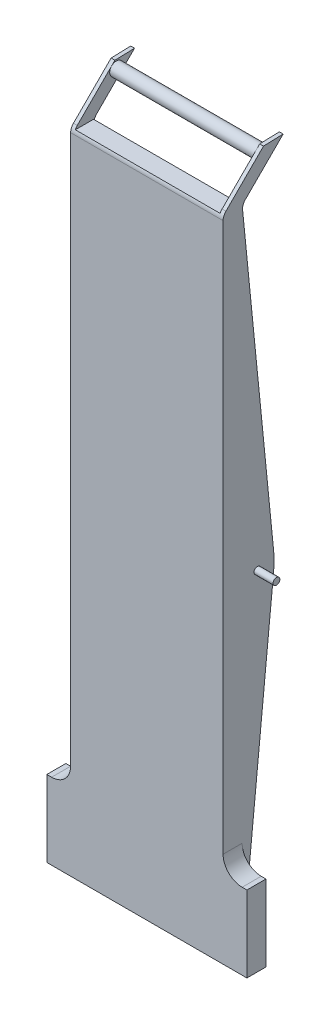
ISO-10303-21;
HEADER;
FILE_DESCRIPTION(('STEP AP214'),'2;1');
FILE_NAME('part.step','',(''),(''),'','','');
FILE_SCHEMA(('AUTOMOTIVE_DESIGN { 1 0 10303 214 1 1 1 1 }'));
ENDSEC;
DATA;
#1=APPLICATION_CONTEXT('core data for automotive mechanical design processes');
#2=APPLICATION_PROTOCOL_DEFINITION('international standard','automotive_design',2000,#1);
#3=PRODUCT_CONTEXT('',#1,'mechanical');
#4=PRODUCT('Part','Part','',(#3));
#5=PRODUCT_RELATED_PRODUCT_CATEGORY('part','',(#4));
#6=PRODUCT_DEFINITION_FORMATION('','',#4);
#7=PRODUCT_DEFINITION_CONTEXT('part definition',#1,'design');
#8=PRODUCT_DEFINITION('design','',#6,#7);
#9=PRODUCT_DEFINITION_SHAPE('','',#8);
#10=(LENGTH_UNIT() NAMED_UNIT(*) SI_UNIT(.MILLI.,.METRE.));
#11=(NAMED_UNIT(*) PLANE_ANGLE_UNIT() SI_UNIT($,.RADIAN.));
#12=(NAMED_UNIT(*) SI_UNIT($,.STERADIAN.) SOLID_ANGLE_UNIT());
#13=UNCERTAINTY_MEASURE_WITH_UNIT(LENGTH_MEASURE(1.E-05),#10,'distance_accuracy_value','');
#14=(GEOMETRIC_REPRESENTATION_CONTEXT(3) GLOBAL_UNCERTAINTY_ASSIGNED_CONTEXT((#13)) GLOBAL_UNIT_ASSIGNED_CONTEXT((#10,
#11,#12)) REPRESENTATION_CONTEXT('',''));
#15=CARTESIAN_POINT('',(0.,0.,0.));
#16=DIRECTION('',(0.,0.,1.));
#17=DIRECTION('',(1.,0.,0.));
#18=AXIS2_PLACEMENT_3D('',#15,#16,#17);
#19=CARTESIAN_POINT('',(-38.,148.139881816995,-5.2109496288609));
#20=DIRECTION('',(1.,0.,0.));
#21=DIRECTION('',(0.,1.,0.));
#22=AXIS2_PLACEMENT_3D('',#19,#20,#21);
#23=CYLINDRICAL_SURFACE('',#22,5.);
#24=DIRECTION('',(-1.,0.,0.));
#25=VECTOR('',#24,1.);
#26=CARTESIAN_POINT('',(-38.,151.675415722928,-1.67541572292816));
#27=LINE('',#26,#25);
#28=CARTESIAN_POINT('',(-38.,151.675415722928,-1.67541572292816));
#29=VERTEX_POINT('',#28);
#30=CARTESIAN_POINT('',(-40.,151.675415722928,-1.67541572292816));
#31=VERTEX_POINT('',#30);
#32=EDGE_CURVE('E390',#29,#31,#27,.T.);
#33=ORIENTED_EDGE('',*,*,#32,.F.);
#34=CARTESIAN_POINT('',(-38.,148.139881816995,-5.2109496288609));
#35=DIRECTION('',(1.,0.,0.));
#36=DIRECTION('',(0.,0.,-1.));
#37=AXIS2_PLACEMENT_3D('',#34,#35,#36);
#38=CIRCLE('',#37,5.);
#39=CARTESIAN_POINT('',(-38.,147.64236322189,-0.23576367781095));
#40=VERTEX_POINT('',#39);
#41=EDGE_CURVE('E49',#29,#40,#38,.T.);
#42=ORIENTED_EDGE('',*,*,#41,.T.);
#43=DIRECTION('',(-1.,0.,0.));
#44=VECTOR('',#43,1.);
#45=CARTESIAN_POINT('',(-38.,147.64236322189,-0.235763677810956));
#46=LINE('',#45,#44);
#47=CARTESIAN_POINT('',(-40.,147.64236322189,-0.235763677810958));
#48=VERTEX_POINT('',#47);
#49=EDGE_CURVE('E395',#48,#40,#46,.F.);
#50=ORIENTED_EDGE('',*,*,#49,.F.);
#51=CARTESIAN_POINT('',(-40.,148.139881816995,-5.2109496288609));
#52=DIRECTION('',(-1.,0.,0.));
#53=DIRECTION('',(0.,-1.,0.));
#54=AXIS2_PLACEMENT_3D('',#51,#52,#53);
#55=CIRCLE('',#54,5.);
#56=EDGE_CURVE('E12',#48,#31,#55,.T.);
#57=ORIENTED_EDGE('',*,*,#56,.T.);
#58=EDGE_LOOP('',(#33,#42,#50,#57));
#59=FACE_BOUND('',#58,.T.);
#60=ADVANCED_FACE('F42',(#59),#23,.F.);
#61=CARTESIAN_POINT('',(38.,148.139881816995,-5.2109496288609));
#62=DIRECTION('',(1.,0.,0.));
#63=DIRECTION('',(0.,1.,0.));
#64=AXIS2_PLACEMENT_3D('',#61,#62,#63);
#65=CYLINDRICAL_SURFACE('',#64,5.);
#66=DIRECTION('',(-1.,0.,0.));
#67=VECTOR('',#66,1.);
#68=CARTESIAN_POINT('',(38.,151.675415722928,-1.67541572292817));
#69=LINE('',#68,#67);
#70=CARTESIAN_POINT('',(40.,151.675415722928,-1.67541572292816));
#71=VERTEX_POINT('',#70);
#72=CARTESIAN_POINT('',(38.,151.675415722928,-1.67541572292816));
#73=VERTEX_POINT('',#72);
#74=EDGE_CURVE('E377',#71,#73,#69,.T.);
#75=ORIENTED_EDGE('',*,*,#74,.F.);
#76=CARTESIAN_POINT('',(40.,148.139881816995,-5.2109496288609));
#77=DIRECTION('',(1.,0.,0.));
#78=DIRECTION('',(0.,0.,-1.));
#79=AXIS2_PLACEMENT_3D('',#76,#77,#78);
#80=CIRCLE('',#79,5.);
#81=CARTESIAN_POINT('',(40.,147.64236322189,-0.235763677810958));
#82=VERTEX_POINT('',#81);
#83=EDGE_CURVE('E386',#71,#82,#80,.T.);
#84=ORIENTED_EDGE('',*,*,#83,.T.);
#85=DIRECTION('',(-1.,0.,0.));
#86=VECTOR('',#85,1.);
#87=CARTESIAN_POINT('',(38.,147.64236322189,-0.235763677810957));
#88=LINE('',#87,#86);
#89=CARTESIAN_POINT('',(38.,147.64236322189,-0.235763677810956));
#90=VERTEX_POINT('',#89);
#91=EDGE_CURVE('E383',#90,#82,#88,.F.);
#92=ORIENTED_EDGE('',*,*,#91,.F.);
#93=CARTESIAN_POINT('',(38.,148.139881816995,-5.2109496288609));
#94=DIRECTION('',(1.,0.,0.));
#95=DIRECTION('',(0.,0.,-1.));
#96=AXIS2_PLACEMENT_3D('',#93,#94,#95);
#97=CIRCLE('',#96,5.);
#98=EDGE_CURVE('E388',#90,#73,#97,.F.);
#99=ORIENTED_EDGE('',*,*,#98,.T.);
#100=EDGE_LOOP('',(#75,#84,#92,#99));
#101=FACE_BOUND('',#100,.T.);
#102=ADVANCED_FACE('F413',(#101),#65,.F.);
#103=CARTESIAN_POINT('',(-38.,147.928932188135,5.));
#104=DIRECTION('',(-1.,0.,0.));
#105=DIRECTION('',(0.,-1.,0.));
#106=AXIS2_PLACEMENT_3D('',#103,#104,#105);
#107=CYLINDRICAL_SURFACE('',#106,5.);
#108=DIRECTION('',(1.,0.,0.));
#109=VECTOR('',#108,1.);
#110=CARTESIAN_POINT('',(-38.,151.464466094067,8.53553390593275));
#111=LINE('',#110,#109);
#112=CARTESIAN_POINT('',(-40.,151.464466094067,8.53553390593274));
#113=VERTEX_POINT('',#112);
#114=CARTESIAN_POINT('',(-38.,151.464466094067,8.53553390593275));
#115=VERTEX_POINT('',#114);
#116=EDGE_CURVE('E207',#113,#115,#111,.T.);
#117=ORIENTED_EDGE('',*,*,#116,.F.);
#118=CARTESIAN_POINT('',(-40.,147.928932188135,5.));
#119=DIRECTION('',(-1.,0.,0.));
#120=DIRECTION('',(0.,-1.,0.));
#121=AXIS2_PLACEMENT_3D('',#118,#119,#120);
#122=CIRCLE('',#121,5.);
#123=CARTESIAN_POINT('',(-40.,147.928932188135,10.));
#124=VERTEX_POINT('',#123);
#125=EDGE_CURVE('E375',#124,#113,#122,.T.);
#126=ORIENTED_EDGE('',*,*,#125,.F.);
#127=DIRECTION('',(1.,0.,0.));
#128=VECTOR('',#127,1.);
#129=CARTESIAN_POINT('',(-38.,147.928932188135,10.));
#130=LINE('',#129,#128);
#131=CARTESIAN_POINT('',(40.,147.928932188135,10.));
#132=VERTEX_POINT('',#131);
#133=EDGE_CURVE('E372',#132,#124,#130,.F.);
#134=ORIENTED_EDGE('',*,*,#133,.F.);
#135=CARTESIAN_POINT('',(40.,147.928932188135,5.));
#136=DIRECTION('',(1.,0.,0.));
#137=DIRECTION('',(0.,0.,-1.));
#138=AXIS2_PLACEMENT_3D('',#135,#136,#137);
#139=CIRCLE('',#138,5.);
#140=CARTESIAN_POINT('',(40.,151.464466094067,8.53553390593275));
#141=VERTEX_POINT('',#140);
#142=EDGE_CURVE('E369',#141,#132,#139,.T.);
#143=ORIENTED_EDGE('',*,*,#142,.F.);
#144=DIRECTION('',(-1.,0.,0.));
#145=VECTOR('',#144,1.);
#146=CARTESIAN_POINT('',(-38.,151.464466094067,8.53553390593274));
#147=LINE('',#146,#145);
#148=CARTESIAN_POINT('',(38.,151.464466094067,8.53553390593275));
#149=VERTEX_POINT('',#148);
#150=EDGE_CURVE('E366',#149,#141,#147,.F.);
#151=ORIENTED_EDGE('',*,*,#150,.F.);
#152=CARTESIAN_POINT('',(38.,147.928932188135,5.));
#153=DIRECTION('',(1.,0.,0.));
#154=DIRECTION('',(0.,0.,-1.));
#155=AXIS2_PLACEMENT_3D('',#152,#153,#154);
#156=CIRCLE('',#155,5.);
#157=CARTESIAN_POINT('',(38.,150.,9.55089860562228));
#158=VERTEX_POINT('',#157);
#159=EDGE_CURVE('E363',#158,#149,#156,.F.);
#160=ORIENTED_EDGE('',*,*,#159,.F.);
#161=DIRECTION('',(-1.,0.,0.));
#162=VECTOR('',#161,1.);
#163=CARTESIAN_POINT('',(-38.,150.,9.55089860562228));
#164=LINE('',#163,#162);
#165=CARTESIAN_POINT('',(-38.,150.,9.55089860562228));
#166=VERTEX_POINT('',#165);
#167=EDGE_CURVE('E360',#166,#158,#164,.F.);
#168=ORIENTED_EDGE('',*,*,#167,.F.);
#169=CARTESIAN_POINT('',(-38.,147.928932188135,5.));
#170=DIRECTION('',(1.,0.,0.));
#171=DIRECTION('',(0.,0.,-1.));
#172=AXIS2_PLACEMENT_3D('',#169,#170,#171);
#173=CIRCLE('',#172,5.);
#174=EDGE_CURVE('E358',#115,#166,#173,.T.);
#175=ORIENTED_EDGE('',*,*,#174,.F.);
#176=EDGE_LOOP('',(#117,#126,#134,#143,#151,#160,#168,#175));
#177=FACE_BOUND('',#176,.T.);
#178=ADVANCED_FACE('F472',(#177),#107,.T.);
#179=CARTESIAN_POINT('',(38.,150.,0.));
#180=DIRECTION('',(0.,-0.707106781186546,-0.707106781186549));
#181=DIRECTION('',(0.,0.707106781186549,-0.707106781186546));
#182=AXIS2_PLACEMENT_3D('',#179,#180,#181);
#183=PLANE('',#182);
#184=DIRECTION('',(0.,0.707106781186549,-0.707106781186546));
#185=VECTOR('',#184,1.);
#186=CARTESIAN_POINT('',(40.,150.,0.));
#187=LINE('',#186,#185);
#188=CARTESIAN_POINT('',(40.,171.533549547824,-21.5335495478236));
#189=VERTEX_POINT('',#188);
#190=EDGE_CURVE('E330',#71,#189,#187,.T.);
#191=ORIENTED_EDGE('',*,*,#190,.F.);
#192=ORIENTED_EDGE('',*,*,#74,.T.);
#193=DIRECTION('',(0.,0.707106781186549,-0.707106781186546));
#194=VECTOR('',#193,1.);
#195=CARTESIAN_POINT('',(38.,150.,0.));
#196=LINE('',#195,#194);
#197=CARTESIAN_POINT('',(38.,171.533549547824,-21.5335495478236));
#198=VERTEX_POINT('',#197);
#199=EDGE_CURVE('E331',#73,#198,#196,.T.);
#200=ORIENTED_EDGE('',*,*,#199,.T.);
#201=DIRECTION('',(1.,0.,0.));
#202=VECTOR('',#201,1.);
#203=CARTESIAN_POINT('',(38.,171.533549547824,-21.5335495478236));
#204=LINE('',#203,#202);
#205=EDGE_CURVE('E343',#198,#189,#204,.T.);
#206=ORIENTED_EDGE('',*,*,#205,.T.);
#207=EDGE_LOOP('',(#191,#192,#200,#206));
#208=FACE_BOUND('',#207,.T.);
#209=ADVANCED_FACE('F482',(#208),#183,.T.);
#210=CARTESIAN_POINT('',(38.,150.,10.));
#211=DIRECTION('',(0.,0.707106781186546,0.707106781186549));
#212=DIRECTION('',(0.,-0.707106781186549,0.707106781186546));
#213=AXIS2_PLACEMENT_3D('',#210,#211,#212);
#214=PLANE('',#213);
#215=DIRECTION('',(0.,-0.707106781186549,0.707106781186546));
#216=VECTOR('',#215,1.);
#217=CARTESIAN_POINT('',(38.,150.,10.));
#218=LINE('',#217,#216);
#219=CARTESIAN_POINT('',(38.,171.213203435596,-11.2132034355964));
#220=VERTEX_POINT('',#219);
#221=EDGE_CURVE('E337',#220,#149,#218,.T.);
#222=ORIENTED_EDGE('',*,*,#221,.T.);
#223=ORIENTED_EDGE('',*,*,#150,.T.);
#224=DIRECTION('',(0.,-0.707106781186549,0.707106781186546));
#225=VECTOR('',#224,1.);
#226=CARTESIAN_POINT('',(40.,150.,10.));
#227=LINE('',#226,#225);
#228=CARTESIAN_POINT('',(40.,171.213203435596,-11.2132034355964));
#229=VERTEX_POINT('',#228);
#230=EDGE_CURVE('E334',#229,#141,#227,.T.);
#231=ORIENTED_EDGE('',*,*,#230,.F.);
#232=DIRECTION('',(1.,0.,0.));
#233=VECTOR('',#232,1.);
#234=CARTESIAN_POINT('',(38.,171.213203435596,-11.2132034355964));
#235=LINE('',#234,#233);
#236=EDGE_CURVE('E350',#220,#229,#235,.T.);
#237=ORIENTED_EDGE('',*,*,#236,.F.);
#238=EDGE_LOOP('',(#222,#223,#231,#237));
#239=FACE_BOUND('',#238,.T.);
#240=ADVANCED_FACE('F476',(#239),#214,.T.);
#241=CARTESIAN_POINT('',(38.,171.533549547824,-21.5335495478236));
#242=DIRECTION('',(0.,0.99951859931679,0.0310253061193878));
#243=DIRECTION('',(0.,-0.0310253061193878,0.99951859931679));
#244=AXIS2_PLACEMENT_3D('',#241,#242,#243);
#245=PLANE('',#244);
#246=DIRECTION('',(0.,-0.0310253061193878,0.99951859931679));
#247=VECTOR('',#246,1.);
#248=CARTESIAN_POINT('',(40.,171.533549547824,-21.5335495478236));
#249=LINE('',#248,#247);
#250=EDGE_CURVE('E345',#189,#229,#249,.T.);
#251=ORIENTED_EDGE('',*,*,#250,.F.);
#252=ORIENTED_EDGE('',*,*,#205,.F.);
#253=DIRECTION('',(0.,-0.0310253061193878,0.99951859931679));
#254=VECTOR('',#253,1.);
#255=CARTESIAN_POINT('',(38.,171.533549547824,-21.5335495478236));
#256=LINE('',#255,#254);
#257=EDGE_CURVE('E333',#198,#220,#256,.T.);
#258=ORIENTED_EDGE('',*,*,#257,.T.);
#259=ORIENTED_EDGE('',*,*,#236,.T.);
#260=EDGE_LOOP('',(#251,#252,#258,#259));
#261=FACE_BOUND('',#260,.T.);
#262=ADVANCED_FACE('F480',(#261),#245,.T.);
#263=CARTESIAN_POINT('',(38.,0.,0.));
#264=DIRECTION('',(1.,0.,0.));
#265=DIRECTION('',(0.,0.,-1.));
#266=AXIS2_PLACEMENT_3D('',#263,#264,#265);
#267=PLANE('',#266);
#268=CARTESIAN_POINT('',(38.,167.,-11.9992449429889));
#269=DIRECTION('',(1.,0.,0.));
#270=DIRECTION('',(0.,0.,-1.));
#271=AXIS2_PLACEMENT_3D('',#268,#269,#270);
#272=CIRCLE('',#271,3.5);
#273=CARTESIAN_POINT('',(38.,167.,-15.4992449429889));
#274=VERTEX_POINT('',#273);
#275=EDGE_CURVE('E327',#274,#274,#272,.T.);
#276=ORIENTED_EDGE('',*,*,#275,.T.);
#277=EDGE_LOOP('',(#276));
#278=FACE_BOUND('',#277,.T.);
#279=DIRECTION('',(0.,0.,-1.));
#280=VECTOR('',#279,1.);
#281=CARTESIAN_POINT('',(38.,150.,0.));
#282=LINE('',#281,#280);
#283=CARTESIAN_POINT('',(38.,150.,0.));
#284=VERTEX_POINT('',#283);
#285=EDGE_CURVE('E340',#158,#284,#282,.T.);
#286=ORIENTED_EDGE('',*,*,#285,.F.);
#287=ORIENTED_EDGE('',*,*,#159,.T.);
#288=ORIENTED_EDGE('',*,*,#221,.F.);
#289=ORIENTED_EDGE('',*,*,#257,.F.);
#290=ORIENTED_EDGE('',*,*,#199,.F.);
#291=ORIENTED_EDGE('',*,*,#98,.F.);
#292=DIRECTION('',(0.,-0.995037190209989,-0.0995037190209991));
#293=VECTOR('',#292,1.);
#294=CARTESIAN_POINT('',(38.,150.,0.));
#295=LINE('',#294,#293);
#296=EDGE_CURVE('E380',#284,#90,#295,.T.);
#297=ORIENTED_EDGE('',*,*,#296,.F.);
#298=EDGE_LOOP('',(#286,#287,#288,#289,#290,#291,#297));
#299=FACE_BOUND('',#298,.T.);
#300=ADVANCED_FACE('F408',(#278,#299),#267,.F.);
#301=CARTESIAN_POINT('',(40.,0.,0.));
#302=DIRECTION('',(1.,0.,0.));
#303=DIRECTION('',(0.,0.,-1.));
#304=AXIS2_PLACEMENT_3D('',#301,#302,#303);
#305=PLANE('',#304);
#306=ORIENTED_EDGE('',*,*,#83,.F.);
#307=ORIENTED_EDGE('',*,*,#190,.T.);
#308=ORIENTED_EDGE('',*,*,#250,.T.);
#309=ORIENTED_EDGE('',*,*,#230,.T.);
#310=ORIENTED_EDGE('',*,*,#142,.T.);
#311=DIRECTION('',(0.,1.,0.));
#312=VECTOR('',#311,1.);
#313=CARTESIAN_POINT('',(40.,150.,10.));
#314=LINE('',#313,#312);
#315=CARTESIAN_POINT('',(40.,-140.,10.));
#316=VERTEX_POINT('',#315);
#317=EDGE_CURVE('E274',#316,#132,#314,.T.);
#318=ORIENTED_EDGE('',*,*,#317,.F.);
#319=DIRECTION('',(0.,0.,-1.));
#320=VECTOR('',#319,1.);
#321=CARTESIAN_POINT('',(40.,-140.,10.));
#322=LINE('',#321,#320);
#323=CARTESIAN_POINT('',(40.,-140.,0.));
#324=VERTEX_POINT('',#323);
#325=EDGE_CURVE('E277',#316,#324,#322,.T.);
#326=ORIENTED_EDGE('',*,*,#325,.T.);
#327=DIRECTION('',(0.,-1.,0.));
#328=VECTOR('',#327,1.);
#329=CARTESIAN_POINT('',(40.,150.,0.));
#330=LINE('',#329,#328);
#331=CARTESIAN_POINT('',(40.,-190.,0.));
#332=VERTEX_POINT('',#331);
#333=EDGE_CURVE('E244',#324,#332,#330,.T.);
#334=ORIENTED_EDGE('',*,*,#333,.T.);
#335=DIRECTION('',(0.,0.995037190209989,-0.099503719020999));
#336=VECTOR('',#335,1.);
#337=CARTESIAN_POINT('',(40.,-190.,0.));
#338=LINE('',#337,#336);
#339=CARTESIAN_POINT('',(40.,-24.9751859510499,-16.502481404895));
#340=VERTEX_POINT('',#339);
#341=EDGE_CURVE('E235',#332,#340,#338,.T.);
#342=ORIENTED_EDGE('',*,*,#341,.T.);
#343=CARTESIAN_POINT('',(40.,-20.,33.2493781056044));
#344=DIRECTION('',(-1.,0.,0.));
#345=DIRECTION('',(0.,-1.,0.));
#346=AXIS2_PLACEMENT_3D('',#343,#344,#345);
#347=CIRCLE('',#346,50.);
#348=CARTESIAN_POINT('',(40.,-15.02481404895,-16.502481404895));
#349=VERTEX_POINT('',#348);
#350=EDGE_CURVE('E320',#340,#349,#347,.F.);
#351=ORIENTED_EDGE('',*,*,#350,.T.);
#352=DIRECTION('',(0.,0.995037190209989,0.0995037190209991));
#353=VECTOR('',#352,1.);
#354=CARTESIAN_POINT('',(40.,150.,0.));
#355=LINE('',#354,#353);
#356=EDGE_CURVE('E251',#349,#82,#355,.T.);
#357=ORIENTED_EDGE('',*,*,#356,.T.);
#358=EDGE_LOOP('',(#306,#307,#308,#309,#310,#318,#326,#334,#342,#351,#357));
#359=FACE_BOUND('',#358,.T.);
#360=ADVANCED_FACE('F416',(#359),#305,.T.);
#361=CARTESIAN_POINT('',(40.,167.,-11.9992449429889));
#362=DIRECTION('',(-1.,0.,0.));
#363=DIRECTION('',(0.,-1.,0.));
#364=AXIS2_PLACEMENT_3D('',#361,#362,#363);
#365=CYLINDRICAL_SURFACE('',#364,3.5);
#366=CARTESIAN_POINT('',(-38.,167.,-11.9992449429889));
#367=DIRECTION('',(1.,0.,0.));
#368=DIRECTION('',(0.,0.,-1.));
#369=AXIS2_PLACEMENT_3D('',#366,#367,#368);
#370=CIRCLE('',#369,3.5);
#371=CARTESIAN_POINT('',(-38.,167.,-15.4992449429889));
#372=VERTEX_POINT('',#371);
#373=EDGE_CURVE('E352',#372,#372,#370,.F.);
#374=ORIENTED_EDGE('',*,*,#373,.F.);
#375=EDGE_LOOP('',(#374));
#376=FACE_BOUND('',#375,.T.);
#377=ORIENTED_EDGE('',*,*,#275,.F.);
#378=EDGE_LOOP('',(#377));
#379=FACE_BOUND('',#378,.T.);
#380=ADVANCED_FACE('F519',(#376,#379),#365,.T.);
#381=CARTESIAN_POINT('',(-40.,150.,10.));
#382=DIRECTION('',(0.,-1.,0.));
#383=DIRECTION('',(0.,0.,-1.));
#384=AXIS2_PLACEMENT_3D('',#381,#382,#383);
#385=PLANE('',#384);
#386=DIRECTION('',(0.,0.,1.));
#387=VECTOR('',#386,1.);
#388=CARTESIAN_POINT('',(-38.,150.,10.));
#389=LINE('',#388,#387);
#390=CARTESIAN_POINT('',(-38.,150.,0.));
#391=VERTEX_POINT('',#390);
#392=EDGE_CURVE('E220',#391,#166,#389,.T.);
#393=ORIENTED_EDGE('',*,*,#392,.T.);
#394=ORIENTED_EDGE('',*,*,#167,.T.);
#395=ORIENTED_EDGE('',*,*,#285,.T.);
#396=DIRECTION('',(-1.,0.,0.));
#397=VECTOR('',#396,1.);
#398=CARTESIAN_POINT('',(-40.,150.,0.));
#399=LINE('',#398,#397);
#400=EDGE_CURVE('E260',#284,#391,#399,.T.);
#401=ORIENTED_EDGE('',*,*,#400,.T.);
#402=EDGE_LOOP('',(#393,#394,#395,#401));
#403=FACE_BOUND('',#402,.T.);
#404=ADVANCED_FACE('F403',(#403),#385,.F.);
#405=CARTESIAN_POINT('',(-50.,-140.,0.));
#406=DIRECTION('',(0.,0.,-1.));
#407=DIRECTION('',(-1.,0.,0.));
#408=AXIS2_PLACEMENT_3D('',#405,#406,#407);
#409=PLANE('',#408);
#410=DIRECTION('',(0.,1.,0.));
#411=VECTOR('',#410,1.);
#412=CARTESIAN_POINT('',(-40.,150.,0.));
#413=LINE('',#412,#411);
#414=CARTESIAN_POINT('',(-40.,-190.,0.));
#415=VERTEX_POINT('',#414);
#416=CARTESIAN_POINT('',(-40.,-140.,0.));
#417=VERTEX_POINT('',#416);
#418=EDGE_CURVE('E239',#415,#417,#413,.T.);
#419=ORIENTED_EDGE('',*,*,#418,.F.);
#420=DIRECTION('',(1.,0.,0.));
#421=VECTOR('',#420,1.);
#422=CARTESIAN_POINT('',(-52.5,-190.,0.));
#423=LINE('',#422,#421);
#424=CARTESIAN_POINT('',(-52.5,-190.,0.));
#425=VERTEX_POINT('',#424);
#426=EDGE_CURVE('E284',#425,#415,#423,.T.);
#427=ORIENTED_EDGE('',*,*,#426,.F.);
#428=DIRECTION('',(0.,-1.,0.));
#429=VECTOR('',#428,1.);
#430=CARTESIAN_POINT('',(-52.5,-150.,0.));
#431=LINE('',#430,#429);
#432=CARTESIAN_POINT('',(-52.5,-150.,0.));
#433=VERTEX_POINT('',#432);
#434=EDGE_CURVE('E281',#433,#425,#431,.T.);
#435=ORIENTED_EDGE('',*,*,#434,.F.);
#436=DIRECTION('',(-1.,0.,0.));
#437=VECTOR('',#436,1.);
#438=CARTESIAN_POINT('',(-52.5,-150.,0.));
#439=LINE('',#438,#437);
#440=CARTESIAN_POINT('',(-50.,-150.,0.));
#441=VERTEX_POINT('',#440);
#442=EDGE_CURVE('E279',#441,#433,#439,.T.);
#443=ORIENTED_EDGE('',*,*,#442,.F.);
#444=CARTESIAN_POINT('',(-50.,-140.,0.));
#445=DIRECTION('',(0.,0.,-1.));
#446=DIRECTION('',(-1.,0.,0.));
#447=AXIS2_PLACEMENT_3D('',#444,#445,#446);
#448=CIRCLE('',#447,10.);
#449=EDGE_CURVE('E256',#417,#441,#448,.T.);
#450=ORIENTED_EDGE('',*,*,#449,.F.);
#451=EDGE_LOOP('',(#419,#427,#435,#443,#450));
#452=FACE_BOUND('',#451,.T.);
#453=ADVANCED_FACE('F464',(#452),#409,.T.);
#454=CARTESIAN_POINT('',(-50.,-140.,10.));
#455=DIRECTION('',(0.,0.,-1.));
#456=DIRECTION('',(-1.,0.,0.));
#457=AXIS2_PLACEMENT_3D('',#454,#455,#456);
#458=CYLINDRICAL_SURFACE('',#457,10.);
#459=ORIENTED_EDGE('',*,*,#449,.T.);
#460=DIRECTION('',(0.,0.,-1.));
#461=VECTOR('',#460,1.);
#462=CARTESIAN_POINT('',(-50.,-150.,10.));
#463=LINE('',#462,#461);
#464=CARTESIAN_POINT('',(-50.,-150.,10.));
#465=VERTEX_POINT('',#464);
#466=EDGE_CURVE('E313',#465,#441,#463,.T.);
#467=ORIENTED_EDGE('',*,*,#466,.F.);
#468=CARTESIAN_POINT('',(-50.,-140.,10.));
#469=DIRECTION('',(0.,0.,-1.));
#470=DIRECTION('',(-1.,0.,0.));
#471=AXIS2_PLACEMENT_3D('',#468,#469,#470);
#472=CIRCLE('',#471,10.);
#473=CARTESIAN_POINT('',(-40.,-140.,10.));
#474=VERTEX_POINT('',#473);
#475=EDGE_CURVE('E259',#474,#465,#472,.T.);
#476=ORIENTED_EDGE('',*,*,#475,.F.);
#477=DIRECTION('',(0.,0.,-1.));
#478=VECTOR('',#477,1.);
#479=CARTESIAN_POINT('',(-40.,-140.,10.));
#480=LINE('',#479,#478);
#481=EDGE_CURVE('E248',#474,#417,#480,.T.);
#482=ORIENTED_EDGE('',*,*,#481,.T.);
#483=EDGE_LOOP('',(#459,#467,#476,#482));
#484=FACE_BOUND('',#483,.T.);
#485=ADVANCED_FACE('F469',(#484),#458,.F.);
#486=CARTESIAN_POINT('',(-52.5,-150.,10.));
#487=DIRECTION('',(0.,-1.,0.));
#488=DIRECTION('',(0.,0.,-1.));
#489=AXIS2_PLACEMENT_3D('',#486,#487,#488);
#490=PLANE('',#489);
#491=ORIENTED_EDGE('',*,*,#442,.T.);
#492=DIRECTION('',(0.,0.,-1.));
#493=VECTOR('',#492,1.);
#494=CARTESIAN_POINT('',(-52.5,-150.,10.));
#495=LINE('',#494,#493);
#496=CARTESIAN_POINT('',(-52.5,-150.,10.));
#497=VERTEX_POINT('',#496);
#498=EDGE_CURVE('E310',#497,#433,#495,.T.);
#499=ORIENTED_EDGE('',*,*,#498,.F.);
#500=DIRECTION('',(-1.,0.,0.));
#501=VECTOR('',#500,1.);
#502=CARTESIAN_POINT('',(-52.5,-150.,10.));
#503=LINE('',#502,#501);
#504=EDGE_CURVE('E262',#465,#497,#503,.T.);
#505=ORIENTED_EDGE('',*,*,#504,.F.);
#506=ORIENTED_EDGE('',*,*,#466,.T.);
#507=EDGE_LOOP('',(#491,#499,#505,#506));
#508=FACE_BOUND('',#507,.T.);
#509=ADVANCED_FACE('F530',(#508),#490,.F.);
#510=CARTESIAN_POINT('',(-52.5,-150.,10.));
#511=DIRECTION('',(1.,0.,0.));
#512=DIRECTION('',(0.,1.,0.));
#513=AXIS2_PLACEMENT_3D('',#510,#511,#512);
#514=PLANE('',#513);
#515=ORIENTED_EDGE('',*,*,#434,.T.);
#516=DIRECTION('',(0.,0.,-1.));
#517=VECTOR('',#516,1.);
#518=CARTESIAN_POINT('',(-52.5,-190.,10.));
#519=LINE('',#518,#517);
#520=CARTESIAN_POINT('',(-52.5,-190.,10.));
#521=VERTEX_POINT('',#520);
#522=EDGE_CURVE('E307',#521,#425,#519,.T.);
#523=ORIENTED_EDGE('',*,*,#522,.F.);
#524=DIRECTION('',(0.,-1.,0.));
#525=VECTOR('',#524,1.);
#526=CARTESIAN_POINT('',(-52.5,-150.,10.));
#527=LINE('',#526,#525);
#528=EDGE_CURVE('E264',#497,#521,#527,.T.);
#529=ORIENTED_EDGE('',*,*,#528,.F.);
#530=ORIENTED_EDGE('',*,*,#498,.T.);
#531=EDGE_LOOP('',(#515,#523,#529,#530));
#532=FACE_BOUND('',#531,.T.);
#533=ADVANCED_FACE('F460',(#532),#514,.F.);
#534=CARTESIAN_POINT('',(-52.5,-190.,10.));
#535=DIRECTION('',(0.,1.,0.));
#536=DIRECTION('',(0.,0.,1.));
#537=AXIS2_PLACEMENT_3D('',#534,#535,#536);
#538=PLANE('',#537);
#539=ORIENTED_EDGE('',*,*,#426,.T.);
#540=DIRECTION('',(1.,0.,0.));
#541=VECTOR('',#540,1.);
#542=CARTESIAN_POINT('',(-380.424734706513,-190.,0.));
#543=LINE('',#542,#541);
#544=EDGE_CURVE('E240',#415,#332,#543,.T.);
#545=ORIENTED_EDGE('',*,*,#544,.T.);
#546=CARTESIAN_POINT('',(52.5,-190.,0.));
#547=VERTEX_POINT('',#546);
#548=EDGE_CURVE('E283',#332,#547,#423,.T.);
#549=ORIENTED_EDGE('',*,*,#548,.T.);
#550=DIRECTION('',(0.,0.,-1.));
#551=VECTOR('',#550,1.);
#552=CARTESIAN_POINT('',(52.5,-190.,10.));
#553=LINE('',#552,#551);
#554=CARTESIAN_POINT('',(52.5,-190.,10.));
#555=VERTEX_POINT('',#554);
#556=EDGE_CURVE('E304',#555,#547,#553,.T.);
#557=ORIENTED_EDGE('',*,*,#556,.F.);
#558=DIRECTION('',(1.,0.,0.));
#559=VECTOR('',#558,1.);
#560=CARTESIAN_POINT('',(-52.5,-190.,10.));
#561=LINE('',#560,#559);
#562=EDGE_CURVE('E266',#521,#555,#561,.T.);
#563=ORIENTED_EDGE('',*,*,#562,.F.);
#564=ORIENTED_EDGE('',*,*,#522,.T.);
#565=EDGE_LOOP('',(#539,#545,#549,#557,#563,#564));
#566=FACE_BOUND('',#565,.T.);
#567=ADVANCED_FACE('F431',(#566),#538,.F.);
#568=CARTESIAN_POINT('',(52.5,-150.,10.));
#569=DIRECTION('',(-1.,0.,0.));
#570=DIRECTION('',(0.,-1.,0.));
#571=AXIS2_PLACEMENT_3D('',#568,#569,#570);
#572=PLANE('',#571);
#573=DIRECTION('',(0.,1.,0.));
#574=VECTOR('',#573,1.);
#575=CARTESIAN_POINT('',(52.5,-150.,0.));
#576=LINE('',#575,#574);
#577=CARTESIAN_POINT('',(52.5,-150.,0.));
#578=VERTEX_POINT('',#577);
#579=EDGE_CURVE('E287',#547,#578,#576,.T.);
#580=ORIENTED_EDGE('',*,*,#579,.T.);
#581=DIRECTION('',(0.,0.,-1.));
#582=VECTOR('',#581,1.);
#583=CARTESIAN_POINT('',(52.5,-150.,10.));
#584=LINE('',#583,#582);
#585=CARTESIAN_POINT('',(52.5,-150.,10.));
#586=VERTEX_POINT('',#585);
#587=EDGE_CURVE('E301',#586,#578,#584,.T.);
#588=ORIENTED_EDGE('',*,*,#587,.F.);
#589=DIRECTION('',(0.,1.,0.));
#590=VECTOR('',#589,1.);
#591=CARTESIAN_POINT('',(52.5,-150.,10.));
#592=LINE('',#591,#590);
#593=EDGE_CURVE('E268',#555,#586,#592,.T.);
#594=ORIENTED_EDGE('',*,*,#593,.F.);
#595=ORIENTED_EDGE('',*,*,#556,.T.);
#596=EDGE_LOOP('',(#580,#588,#594,#595));
#597=FACE_BOUND('',#596,.T.);
#598=ADVANCED_FACE('F451',(#597),#572,.F.);
#599=CARTESIAN_POINT('',(50.,-150.,10.));
#600=DIRECTION('',(0.,-1.,0.));
#601=DIRECTION('',(0.,0.,-1.));
#602=AXIS2_PLACEMENT_3D('',#599,#600,#601);
#603=PLANE('',#602);
#604=DIRECTION('',(-1.,0.,0.));
#605=VECTOR('',#604,1.);
#606=CARTESIAN_POINT('',(50.,-150.,0.));
#607=LINE('',#606,#605);
#608=CARTESIAN_POINT('',(50.,-150.,0.));
#609=VERTEX_POINT('',#608);
#610=EDGE_CURVE('E289',#578,#609,#607,.T.);
#611=ORIENTED_EDGE('',*,*,#610,.T.);
#612=DIRECTION('',(0.,0.,-1.));
#613=VECTOR('',#612,1.);
#614=CARTESIAN_POINT('',(50.,-150.,10.));
#615=LINE('',#614,#613);
#616=CARTESIAN_POINT('',(50.,-150.,10.));
#617=VERTEX_POINT('',#616);
#618=EDGE_CURVE('E298',#617,#609,#615,.T.);
#619=ORIENTED_EDGE('',*,*,#618,.F.);
#620=DIRECTION('',(-1.,0.,0.));
#621=VECTOR('',#620,1.);
#622=CARTESIAN_POINT('',(50.,-150.,10.));
#623=LINE('',#622,#621);
#624=EDGE_CURVE('E270',#586,#617,#623,.T.);
#625=ORIENTED_EDGE('',*,*,#624,.F.);
#626=ORIENTED_EDGE('',*,*,#587,.T.);
#627=EDGE_LOOP('',(#611,#619,#625,#626));
#628=FACE_BOUND('',#627,.T.);
#629=ADVANCED_FACE('F446',(#628),#603,.F.);
#630=CARTESIAN_POINT('',(50.,-140.,10.));
#631=DIRECTION('',(0.,0.,-1.));
#632=DIRECTION('',(-1.,0.,0.));
#633=AXIS2_PLACEMENT_3D('',#630,#631,#632);
#634=CYLINDRICAL_SURFACE('',#633,10.);
#635=CARTESIAN_POINT('',(50.,-140.,0.));
#636=DIRECTION('',(0.,0.,-1.));
#637=DIRECTION('',(-1.,0.,0.));
#638=AXIS2_PLACEMENT_3D('',#635,#636,#637);
#639=CIRCLE('',#638,10.);
#640=EDGE_CURVE('E291',#609,#324,#639,.T.);
#641=ORIENTED_EDGE('',*,*,#640,.T.);
#642=ORIENTED_EDGE('',*,*,#325,.F.);
#643=CARTESIAN_POINT('',(50.,-140.,10.));
#644=DIRECTION('',(0.,0.,-1.));
#645=DIRECTION('',(-1.,0.,0.));
#646=AXIS2_PLACEMENT_3D('',#643,#644,#645);
#647=CIRCLE('',#646,10.);
#648=EDGE_CURVE('E272',#617,#316,#647,.T.);
#649=ORIENTED_EDGE('',*,*,#648,.F.);
#650=ORIENTED_EDGE('',*,*,#618,.T.);
#651=EDGE_LOOP('',(#641,#642,#649,#650));
#652=FACE_BOUND('',#651,.T.);
#653=ADVANCED_FACE('F443',(#652),#634,.F.);
#654=CARTESIAN_POINT('',(-50.,-140.,10.));
#655=DIRECTION('',(0.,0.,-1.));
#656=DIRECTION('',(-1.,0.,0.));
#657=AXIS2_PLACEMENT_3D('',#654,#655,#656);
#658=PLANE('',#657);
#659=ORIENTED_EDGE('',*,*,#317,.T.);
#660=ORIENTED_EDGE('',*,*,#133,.T.);
#661=DIRECTION('',(0.,-1.,0.));
#662=VECTOR('',#661,1.);
#663=CARTESIAN_POINT('',(-40.,150.,10.));
#664=LINE('',#663,#662);
#665=EDGE_CURVE('E257',#124,#474,#664,.T.);
#666=ORIENTED_EDGE('',*,*,#665,.T.);
#667=ORIENTED_EDGE('',*,*,#475,.T.);
#668=ORIENTED_EDGE('',*,*,#504,.T.);
#669=ORIENTED_EDGE('',*,*,#528,.T.);
#670=ORIENTED_EDGE('',*,*,#562,.T.);
#671=ORIENTED_EDGE('',*,*,#593,.T.);
#672=ORIENTED_EDGE('',*,*,#624,.T.);
#673=ORIENTED_EDGE('',*,*,#648,.T.);
#674=EDGE_LOOP('',(#659,#660,#666,#667,#668,#669,#670,#671,#672,#673));
#675=FACE_BOUND('',#674,.T.);
#676=ADVANCED_FACE('F455',(#675),#658,.F.);
#677=ORIENTED_EDGE('',*,*,#333,.F.);
#678=ORIENTED_EDGE('',*,*,#640,.F.);
#679=ORIENTED_EDGE('',*,*,#610,.F.);
#680=ORIENTED_EDGE('',*,*,#579,.F.);
#681=ORIENTED_EDGE('',*,*,#548,.F.);
#682=EDGE_LOOP('',(#677,#678,#679,#680,#681));
#683=FACE_BOUND('',#682,.T.);
#684=ADVANCED_FACE('F436',(#683),#409,.T.);
#685=CARTESIAN_POINT('',(-380.424734706513,150.,0.));
#686=DIRECTION('',(0.,0.099503719020999,-0.995037190209989));
#687=DIRECTION('',(0.,0.995037190209989,0.0995037190209991));
#688=AXIS2_PLACEMENT_3D('',#685,#686,#687);
#689=PLANE('',#688);
#690=DIRECTION('',(0.,-0.995037190209989,-0.0995037190209991));
#691=VECTOR('',#690,1.);
#692=CARTESIAN_POINT('',(-40.,150.,0.));
#693=LINE('',#692,#691);
#694=CARTESIAN_POINT('',(-40.,-15.0248140489501,-16.502481404895));
#695=VERTEX_POINT('',#694);
#696=EDGE_CURVE('E237',#48,#695,#693,.T.);
#697=ORIENTED_EDGE('',*,*,#696,.F.);
#698=ORIENTED_EDGE('',*,*,#49,.T.);
#699=DIRECTION('',(0.,0.995037190209989,0.0995037190209991));
#700=VECTOR('',#699,1.);
#701=CARTESIAN_POINT('',(-38.,1.48514851485149,-14.8514851485149));
#702=LINE('',#701,#700);
#703=EDGE_CURVE('E393',#40,#391,#702,.T.);
#704=ORIENTED_EDGE('',*,*,#703,.T.);
#705=ORIENTED_EDGE('',*,*,#400,.F.);
#706=ORIENTED_EDGE('',*,*,#296,.T.);
#707=ORIENTED_EDGE('',*,*,#91,.T.);
#708=ORIENTED_EDGE('',*,*,#356,.F.);
#709=DIRECTION('',(1.,0.,0.));
#710=VECTOR('',#709,1.);
#711=CARTESIAN_POINT('',(-380.424734706513,-15.0248140489501,-16.502481404895));
#712=LINE('',#711,#710);
#713=EDGE_CURVE('E322',#349,#695,#712,.F.);
#714=ORIENTED_EDGE('',*,*,#713,.T.);
#715=EDGE_LOOP('',(#697,#698,#704,#705,#706,#707,#708,#714));
#716=FACE_BOUND('',#715,.T.);
#717=ADVANCED_FACE('F399',(#716),#689,.T.);
#718=CARTESIAN_POINT('',(-380.424734706513,-190.,0.));
#719=DIRECTION('',(0.,-0.099503719020999,-0.995037190209989));
#720=DIRECTION('',(0.,0.995037190209989,-0.0995037190209991));
#721=AXIS2_PLACEMENT_3D('',#718,#719,#720);
#722=PLANE('',#721);
#723=DIRECTION('',(0.,-0.995037190209989,0.0995037190209991));
#724=VECTOR('',#723,1.);
#725=CARTESIAN_POINT('',(-40.,-190.,0.));
#726=LINE('',#725,#724);
#727=CARTESIAN_POINT('',(-40.,-24.9751859510499,-16.502481404895));
#728=VERTEX_POINT('',#727);
#729=EDGE_CURVE('E243',#728,#415,#726,.T.);
#730=ORIENTED_EDGE('',*,*,#729,.F.);
#731=DIRECTION('',(1.,0.,0.));
#732=VECTOR('',#731,1.);
#733=CARTESIAN_POINT('',(-380.424734706513,-24.9751859510499,-16.502481404895));
#734=LINE('',#733,#732);
#735=EDGE_CURVE('E247',#728,#340,#734,.T.);
#736=ORIENTED_EDGE('',*,*,#735,.T.);
#737=ORIENTED_EDGE('',*,*,#341,.F.);
#738=ORIENTED_EDGE('',*,*,#544,.F.);
#739=EDGE_LOOP('',(#730,#736,#737,#738));
#740=FACE_BOUND('',#739,.T.);
#741=ADVANCED_FACE('F427',(#740),#722,.T.);
#742=CARTESIAN_POINT('',(-380.424734706513,-20.,33.2493781056044));
#743=DIRECTION('',(1.,0.,0.));
#744=DIRECTION('',(0.,1.,0.));
#745=AXIS2_PLACEMENT_3D('',#742,#743,#744);
#746=CYLINDRICAL_SURFACE('',#745,50.);
#747=CARTESIAN_POINT('',(-40.,-20.,33.2493781056044));
#748=DIRECTION('',(1.,0.,0.));
#749=DIRECTION('',(0.,1.,0.));
#750=AXIS2_PLACEMENT_3D('',#747,#748,#749);
#751=CIRCLE('',#750,50.);
#752=EDGE_CURVE('E325',#695,#728,#751,.F.);
#753=ORIENTED_EDGE('',*,*,#752,.F.);
#754=ORIENTED_EDGE('',*,*,#713,.F.);
#755=ORIENTED_EDGE('',*,*,#350,.F.);
#756=ORIENTED_EDGE('',*,*,#735,.F.);
#757=EDGE_LOOP('',(#753,#754,#755,#756));
#758=FACE_BOUND('',#757,.T.);
#759=ADVANCED_FACE('F420',(#758),#746,.T.);
#760=CARTESIAN_POINT('',(-38.,171.213203435596,-11.2132034355964));
#761=DIRECTION('',(0.,0.707106781186546,0.707106781186549));
#762=DIRECTION('',(0.,-0.707106781186549,0.707106781186546));
#763=AXIS2_PLACEMENT_3D('',#760,#761,#762);
#764=PLANE('',#763);
#765=DIRECTION('',(0.,0.707106781186549,-0.707106781186546));
#766=VECTOR('',#765,1.);
#767=CARTESIAN_POINT('',(-40.,171.213203435596,-11.2132034355964));
#768=LINE('',#767,#766);
#769=CARTESIAN_POINT('',(-40.,171.213203435596,-11.2132034355964));
#770=VERTEX_POINT('',#769);
#771=EDGE_CURVE('E231',#113,#770,#768,.T.);
#772=ORIENTED_EDGE('',*,*,#771,.F.);
#773=ORIENTED_EDGE('',*,*,#116,.T.);
#774=DIRECTION('',(0.,0.707106781186549,-0.707106781186546));
#775=VECTOR('',#774,1.);
#776=CARTESIAN_POINT('',(-38.,171.213203435596,-11.2132034355964));
#777=LINE('',#776,#775);
#778=CARTESIAN_POINT('',(-38.,171.213203435596,-11.2132034355964));
#779=VERTEX_POINT('',#778);
#780=EDGE_CURVE('E200',#115,#779,#777,.T.);
#781=ORIENTED_EDGE('',*,*,#780,.T.);
#782=DIRECTION('',(-1.,0.,0.));
#783=VECTOR('',#782,1.);
#784=CARTESIAN_POINT('',(-38.,171.213203435596,-11.2132034355964));
#785=LINE('',#784,#783);
#786=EDGE_CURVE('E204',#779,#770,#785,.T.);
#787=ORIENTED_EDGE('',*,*,#786,.T.);
#788=EDGE_LOOP('',(#772,#773,#781,#787));
#789=FACE_BOUND('',#788,.T.);
#790=ADVANCED_FACE('F203',(#789),#764,.T.);
#791=CARTESIAN_POINT('',(-38.,150.,0.));
#792=DIRECTION('',(0.,-0.707106781186546,-0.707106781186549));
#793=DIRECTION('',(0.,0.707106781186549,-0.707106781186546));
#794=AXIS2_PLACEMENT_3D('',#791,#792,#793);
#795=PLANE('',#794);
#796=DIRECTION('',(0.,-0.707106781186549,0.707106781186546));
#797=VECTOR('',#796,1.);
#798=CARTESIAN_POINT('',(-38.,150.,0.));
#799=LINE('',#798,#797);
#800=CARTESIAN_POINT('',(-38.,171.533549547824,-21.5335495478236));
#801=VERTEX_POINT('',#800);
#802=EDGE_CURVE('E225',#801,#29,#799,.T.);
#803=ORIENTED_EDGE('',*,*,#802,.T.);
#804=ORIENTED_EDGE('',*,*,#32,.T.);
#805=DIRECTION('',(0.,-0.707106781186549,0.707106781186546));
#806=VECTOR('',#805,1.);
#807=CARTESIAN_POINT('',(-40.,150.,0.));
#808=LINE('',#807,#806);
#809=CARTESIAN_POINT('',(-40.,171.533549547824,-21.5335495478236));
#810=VERTEX_POINT('',#809);
#811=EDGE_CURVE('E212',#810,#31,#808,.T.);
#812=ORIENTED_EDGE('',*,*,#811,.F.);
#813=DIRECTION('',(-1.,0.,0.));
#814=VECTOR('',#813,1.);
#815=CARTESIAN_POINT('',(-38.,171.533549547824,-21.5335495478236));
#816=LINE('',#815,#814);
#817=EDGE_CURVE('E219',#801,#810,#816,.T.);
#818=ORIENTED_EDGE('',*,*,#817,.F.);
#819=EDGE_LOOP('',(#803,#804,#812,#818));
#820=FACE_BOUND('',#819,.T.);
#821=ADVANCED_FACE('F498',(#820),#795,.T.);
#822=CARTESIAN_POINT('',(-38.,171.533549547824,-21.5335495478236));
#823=DIRECTION('',(0.,0.99951859931679,0.0310253061193878));
#824=DIRECTION('',(0.,-0.0310253061193878,0.99951859931679));
#825=AXIS2_PLACEMENT_3D('',#822,#823,#824);
#826=PLANE('',#825);
#827=DIRECTION('',(0.,0.0310253061193878,-0.99951859931679));
#828=VECTOR('',#827,1.);
#829=CARTESIAN_POINT('',(-40.,171.533549547824,-21.5335495478236));
#830=LINE('',#829,#828);
#831=EDGE_CURVE('E218',#770,#810,#830,.T.);
#832=ORIENTED_EDGE('',*,*,#831,.F.);
#833=ORIENTED_EDGE('',*,*,#786,.F.);
#834=DIRECTION('',(0.,0.0310253061193878,-0.99951859931679));
#835=VECTOR('',#834,1.);
#836=CARTESIAN_POINT('',(-38.,171.533549547824,-21.5335495478236));
#837=LINE('',#836,#835);
#838=EDGE_CURVE('E211',#779,#801,#837,.T.);
#839=ORIENTED_EDGE('',*,*,#838,.T.);
#840=ORIENTED_EDGE('',*,*,#817,.T.);
#841=EDGE_LOOP('',(#832,#833,#839,#840));
#842=FACE_BOUND('',#841,.T.);
#843=ADVANCED_FACE('F216',(#842),#826,.T.);
#844=CARTESIAN_POINT('',(-38.,0.,0.));
#845=DIRECTION('',(1.,0.,0.));
#846=DIRECTION('',(0.,0.,-1.));
#847=AXIS2_PLACEMENT_3D('',#844,#845,#846);
#848=PLANE('',#847);
#849=ORIENTED_EDGE('',*,*,#373,.T.);
#850=EDGE_LOOP('',(#849));
#851=FACE_BOUND('',#850,.T.);
#852=ORIENTED_EDGE('',*,*,#780,.F.);
#853=ORIENTED_EDGE('',*,*,#174,.T.);
#854=ORIENTED_EDGE('',*,*,#392,.F.);
#855=ORIENTED_EDGE('',*,*,#703,.F.);
#856=ORIENTED_EDGE('',*,*,#41,.F.);
#857=ORIENTED_EDGE('',*,*,#802,.F.);
#858=ORIENTED_EDGE('',*,*,#838,.F.);
#859=EDGE_LOOP('',(#852,#853,#854,#855,#856,#857,#858));
#860=FACE_BOUND('',#859,.T.);
#861=ADVANCED_FACE('F223',(#851,#860),#848,.T.);
#862=CARTESIAN_POINT('',(-40.,167.,-11.9992449429889));
#863=DIRECTION('',(-1.,0.,0.));
#864=DIRECTION('',(0.,-1.,0.));
#865=AXIS2_PLACEMENT_3D('',#862,#863,#864);
#866=PLANE('',#865);
#867=ORIENTED_EDGE('',*,*,#56,.F.);
#868=ORIENTED_EDGE('',*,*,#696,.T.);
#869=ORIENTED_EDGE('',*,*,#752,.T.);
#870=ORIENTED_EDGE('',*,*,#729,.T.);
#871=ORIENTED_EDGE('',*,*,#418,.T.);
#872=ORIENTED_EDGE('',*,*,#481,.F.);
#873=ORIENTED_EDGE('',*,*,#665,.F.);
#874=ORIENTED_EDGE('',*,*,#125,.T.);
#875=ORIENTED_EDGE('',*,*,#771,.T.);
#876=ORIENTED_EDGE('',*,*,#831,.T.);
#877=ORIENTED_EDGE('',*,*,#811,.T.);
#878=EDGE_LOOP('',(#867,#868,#869,#870,#871,#872,#873,#874,#875,#876,#877));
#879=FACE_BOUND('',#878,.T.);
#880=ADVANCED_FACE('F423',(#879),#866,.T.);
#881=CLOSED_SHELL('',(#60,#102,#178,#209,#240,#262,#300,#360,#380,#404,#453,#485,#509,#533,#567,
#598,#629,#653,#676,#684,#717,#741,#759,#790,#821,#843,#861,#880));
#882=MANIFOLD_SOLID_BREP('B2',#881);
#883=CARTESIAN_POINT('',(-50.,-20.,-8.));
#884=DIRECTION('',(1.,0.,0.));
#885=DIRECTION('',(0.,1.,0.));
#886=AXIS2_PLACEMENT_3D('',#883,#884,#885);
#887=CYLINDRICAL_SURFACE('',#886,1.77629463422373);
#888=CARTESIAN_POINT('',(-50.,-20.,-8.));
#889=DIRECTION('',(1.,0.,0.));
#890=DIRECTION('',(0.,1.,0.));
#891=AXIS2_PLACEMENT_3D('',#888,#889,#890);
#892=CIRCLE('',#891,1.77629463422373);
#893=CARTESIAN_POINT('',(-50.,-18.2237053657763,-8.));
#894=VERTEX_POINT('',#893);
#895=EDGE_CURVE('E41',#894,#894,#892,.T.);
#896=CARTESIAN_POINT('',(50.,-20.,-8.));
#897=DIRECTION('',(1.,0.,0.));
#898=DIRECTION('',(0.,1.,0.));
#899=AXIS2_PLACEMENT_3D('',#896,#897,#898);
#900=CIRCLE('',#899,1.77629463422373);
#901=CARTESIAN_POINT('',(50.,-18.2237053657763,-8.));
#902=VERTEX_POINT('',#901);
#903=EDGE_CURVE('E739',#902,#902,#900,.T.);
#904=CARTESIAN_POINT('',(-50.,-18.2237053657763,-8.));
#905=CARTESIAN_POINT('',(-48.9583333333333,-18.2237053657763,-8.));
#906=CARTESIAN_POINT('',(-47.9166666666667,-18.2237053657763,-8.));
#907=CARTESIAN_POINT('',(-45.8333333333333,-18.2237053657763,-8.));
#908=CARTESIAN_POINT('',(-44.7916666666667,-18.2237053657763,-8.));
#909=CARTESIAN_POINT('',(-42.7083333333333,-18.2237053657763,-8.));
#910=CARTESIAN_POINT('',(-41.6666666666667,-18.2237053657763,-8.));
#911=CARTESIAN_POINT('',(-39.5833333333333,-18.2237053657763,-8.));
#912=CARTESIAN_POINT('',(-38.5416666666667,-18.2237053657763,-8.));
#913=CARTESIAN_POINT('',(-36.4583333333333,-18.2237053657763,-8.));
#914=CARTESIAN_POINT('',(-35.4166666666667,-18.2237053657763,-8.));
#915=CARTESIAN_POINT('',(-33.3333333333333,-18.2237053657763,-8.));
#916=CARTESIAN_POINT('',(-32.2916666666667,-18.2237053657763,-8.));
#917=CARTESIAN_POINT('',(-30.2083333333333,-18.2237053657763,-8.));
#918=CARTESIAN_POINT('',(-29.1666666666667,-18.2237053657763,-8.));
#919=CARTESIAN_POINT('',(-27.0833333333333,-18.2237053657763,-8.));
#920=CARTESIAN_POINT('',(-26.0416666666667,-18.2237053657763,-8.));
#921=CARTESIAN_POINT('',(-23.9583333333333,-18.2237053657763,-8.));
#922=CARTESIAN_POINT('',(-22.9166666666667,-18.2237053657763,-8.));
#923=CARTESIAN_POINT('',(-20.8333333333333,-18.2237053657763,-8.));
#924=CARTESIAN_POINT('',(-19.7916666666667,-18.2237053657763,-8.));
#925=CARTESIAN_POINT('',(-17.7083333333333,-18.2237053657763,-8.));
#926=CARTESIAN_POINT('',(-16.6666666666667,-18.2237053657763,-8.));
#927=CARTESIAN_POINT('',(-14.5833333333333,-18.2237053657763,-8.));
#928=CARTESIAN_POINT('',(-13.5416666666667,-18.2237053657763,-8.));
#929=CARTESIAN_POINT('',(-11.4583333333333,-18.2237053657763,-8.));
#930=CARTESIAN_POINT('',(-10.4166666666667,-18.2237053657763,-8.));
#931=CARTESIAN_POINT('',(-8.33333333333333,-18.2237053657763,-8.));
#932=CARTESIAN_POINT('',(-7.29166666666667,-18.2237053657763,-8.));
#933=CARTESIAN_POINT('',(-5.20833333333333,-18.2237053657763,-8.));
#934=CARTESIAN_POINT('',(-4.16666666666667,-18.2237053657763,-8.));
#935=CARTESIAN_POINT('',(-2.08333333333334,-18.2237053657763,-8.));
#936=CARTESIAN_POINT('',(-1.04166666666667,-18.2237053657763,-8.));
#937=CARTESIAN_POINT('',(1.04166666666667,-18.2237053657763,-8.));
#938=CARTESIAN_POINT('',(2.08333333333334,-18.2237053657763,-8.));
#939=CARTESIAN_POINT('',(4.16666666666667,-18.2237053657763,-8.));
#940=CARTESIAN_POINT('',(5.20833333333333,-18.2237053657763,-8.));
#941=CARTESIAN_POINT('',(7.29166666666667,-18.2237053657763,-8.));
#942=CARTESIAN_POINT('',(8.33333333333334,-18.2237053657763,-8.));
#943=CARTESIAN_POINT('',(10.4166666666667,-18.2237053657763,-8.));
#944=CARTESIAN_POINT('',(11.4583333333333,-18.2237053657763,-8.));
#945=CARTESIAN_POINT('',(13.5416666666667,-18.2237053657763,-8.));
#946=CARTESIAN_POINT('',(14.5833333333333,-18.2237053657763,-8.));
#947=CARTESIAN_POINT('',(16.6666666666667,-18.2237053657763,-8.));
#948=CARTESIAN_POINT('',(17.7083333333333,-18.2237053657763,-8.));
#949=CARTESIAN_POINT('',(19.7916666666667,-18.2237053657763,-8.));
#950=CARTESIAN_POINT('',(20.8333333333333,-18.2237053657763,-8.));
#951=CARTESIAN_POINT('',(22.9166666666667,-18.2237053657763,-8.));
#952=CARTESIAN_POINT('',(23.9583333333333,-18.2237053657763,-8.));
#953=CARTESIAN_POINT('',(26.0416666666667,-18.2237053657763,-8.));
#954=CARTESIAN_POINT('',(27.0833333333333,-18.2237053657763,-8.));
#955=CARTESIAN_POINT('',(29.1666666666667,-18.2237053657763,-8.));
#956=CARTESIAN_POINT('',(30.2083333333333,-18.2237053657763,-8.));
#957=CARTESIAN_POINT('',(32.2916666666667,-18.2237053657763,-8.));
#958=CARTESIAN_POINT('',(33.3333333333333,-18.2237053657763,-8.));
#959=CARTESIAN_POINT('',(35.4166666666667,-18.2237053657763,-8.));
#960=CARTESIAN_POINT('',(36.4583333333333,-18.2237053657763,-8.));
#961=CARTESIAN_POINT('',(38.5416666666667,-18.2237053657763,-8.));
#962=CARTESIAN_POINT('',(39.5833333333333,-18.2237053657763,-8.));
#963=CARTESIAN_POINT('',(41.6666666666667,-18.2237053657763,-8.));
#964=CARTESIAN_POINT('',(42.7083333333333,-18.2237053657763,-8.));
#965=CARTESIAN_POINT('',(44.7916666666667,-18.2237053657763,-8.));
#966=CARTESIAN_POINT('',(45.8333333333333,-18.2237053657763,-8.));
#967=CARTESIAN_POINT('',(47.9166666666667,-18.2237053657763,-8.));
#968=CARTESIAN_POINT('',(48.9583333333333,-18.2237053657763,-8.));
#969=CARTESIAN_POINT('',(50.,-18.2237053657763,-8.));
#970=B_SPLINE_CURVE_WITH_KNOTS('',3,(#904,#905,#906,#907,#908,#909,#910,#911,#912,#913,#914,
#915,#916,#917,#918,#919,#920,#921,#922,#923,#924,#925,#926,#927,#928,#929,#930,#931,#932,#933,
#934,#935,#936,#937,#938,#939,#940,#941,#942,#943,#944,#945,#946,#947,#948,#949,#950,#951,#952,
#953,#954,#955,#956,#957,#958,#959,#960,#961,#962,#963,#964,#965,#966,#967,#968,#969),
.UNSPECIFIED.,.F.,.F.,(4,2,2,2,2,2,2,2,2,2,2,2,2,2,2,2,2,2,2,2,2,2,2,2,2,2,2,2,2,2,2,2,4),(0.,
3.125,6.25000000000001,9.375,12.5,15.625,18.75,21.875,25.,28.125,31.25,34.375,37.5,40.625,43.75,
46.875,50.,53.125,56.25,59.375,62.5,65.625,68.75,71.875,75.,78.125,81.25,84.375,87.5,90.625,
93.75,96.875,100.),.UNSPECIFIED.);
#971=EDGE_CURVE('BSEAM733',#894,#902,#970,.T.);
#972=ORIENTED_EDGE('',*,*,#895,.T.);
#973=ORIENTED_EDGE('',*,*,#903,.F.);
#974=ORIENTED_EDGE('',*,*,#971,.T.);
#975=ORIENTED_EDGE('',*,*,#971,.F.);
#976=EDGE_LOOP('',(#972,#974,#973,#975));
#977=FACE_BOUND('',#976,.T.);
#978=ADVANCED_FACE('F733',(#977),#887,.T.);
#979=CARTESIAN_POINT('',(-50.,-20.,-8.));
#980=DIRECTION('',(1.,0.,0.));
#981=DIRECTION('',(0.,1.,0.));
#982=AXIS2_PLACEMENT_3D('',#979,#980,#981);
#983=PLANE('',#982);
#984=ORIENTED_EDGE('',*,*,#895,.F.);
#985=EDGE_LOOP('',(#984));
#986=FACE_BOUND('',#985,.T.);
#987=ADVANCED_FACE('F748',(#986),#983,.F.);
#988=CARTESIAN_POINT('',(50.,-20.,-8.));
#989=DIRECTION('',(1.,0.,0.));
#990=DIRECTION('',(0.,1.,0.));
#991=AXIS2_PLACEMENT_3D('',#988,#989,#990);
#992=PLANE('',#991);
#993=ORIENTED_EDGE('',*,*,#903,.T.);
#994=EDGE_LOOP('',(#993));
#995=FACE_BOUND('',#994,.T.);
#996=ADVANCED_FACE('F745',(#995),#992,.T.);
#997=CLOSED_SHELL('',(#978,#987,#996));
#998=MANIFOLD_SOLID_BREP('B6',#997);
#999=ADVANCED_BREP_SHAPE_REPRESENTATION('',(#18,#882,#998),#14);
#1000=SHAPE_DEFINITION_REPRESENTATION(#9,#999);
ENDSEC;
END-ISO-10303-21;
